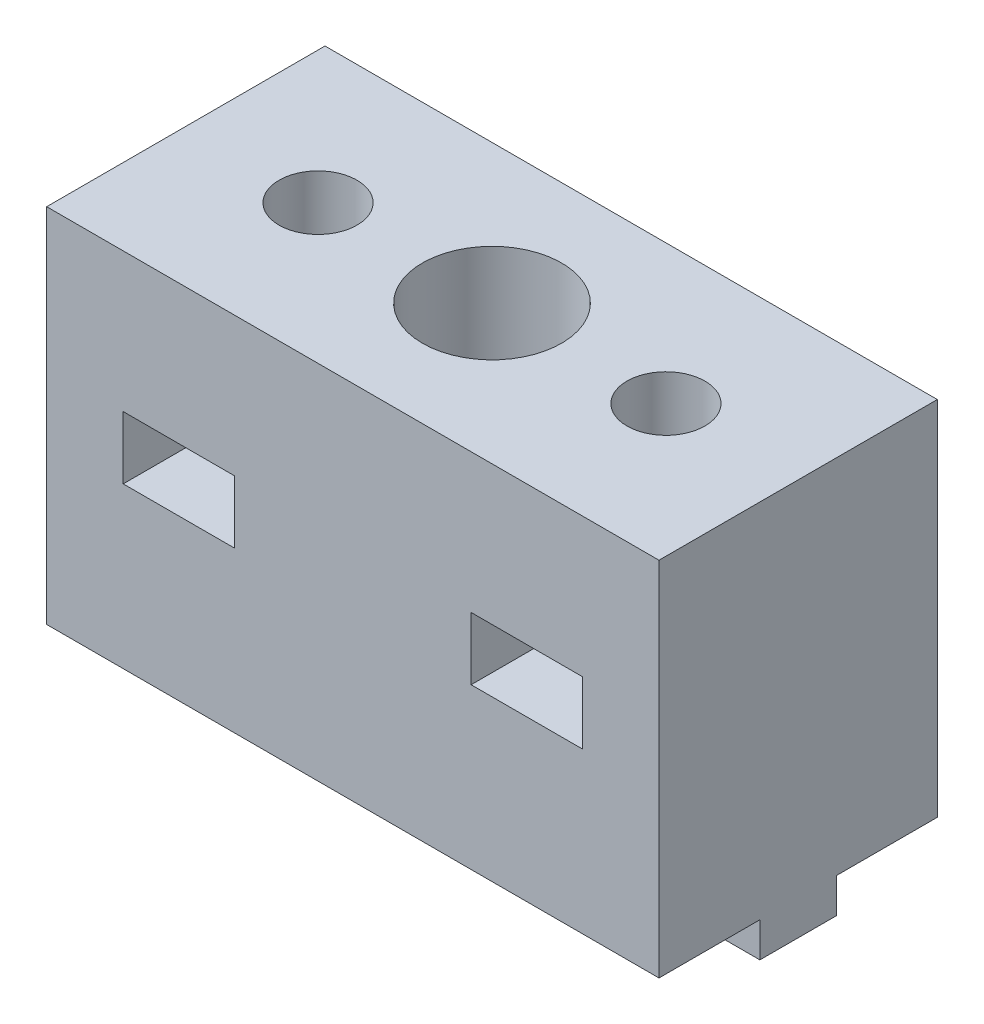
ISO-10303-21;
HEADER;
FILE_DESCRIPTION(('STEP AP214'),'2;1');
FILE_NAME('part.step','',(''),(''),'','','');
FILE_SCHEMA(('AUTOMOTIVE_DESIGN { 1 0 10303 214 1 1 1 1 }'));
ENDSEC;
DATA;
#1=APPLICATION_CONTEXT('core data for automotive mechanical design processes');
#2=APPLICATION_PROTOCOL_DEFINITION('international standard','automotive_design',2000,#1);
#3=PRODUCT_CONTEXT('',#1,'mechanical');
#4=PRODUCT('Part','Part','',(#3));
#5=PRODUCT_RELATED_PRODUCT_CATEGORY('part','',(#4));
#6=PRODUCT_DEFINITION_FORMATION('','',#4);
#7=PRODUCT_DEFINITION_CONTEXT('part definition',#1,'design');
#8=PRODUCT_DEFINITION('design','',#6,#7);
#9=PRODUCT_DEFINITION_SHAPE('','',#8);
#10=(LENGTH_UNIT() NAMED_UNIT(*) SI_UNIT(.MILLI.,.METRE.));
#11=(NAMED_UNIT(*) PLANE_ANGLE_UNIT() SI_UNIT($,.RADIAN.));
#12=(NAMED_UNIT(*) SI_UNIT($,.STERADIAN.) SOLID_ANGLE_UNIT());
#13=UNCERTAINTY_MEASURE_WITH_UNIT(LENGTH_MEASURE(1.E-05),#10,'distance_accuracy_value','');
#14=(GEOMETRIC_REPRESENTATION_CONTEXT(3) GLOBAL_UNCERTAINTY_ASSIGNED_CONTEXT((#13)) GLOBAL_UNIT_ASSIGNED_CONTEXT((#10,
#11,#12)) REPRESENTATION_CONTEXT('',''));
#15=CARTESIAN_POINT('',(0.,0.,0.));
#16=DIRECTION('',(0.,0.,1.));
#17=DIRECTION('',(1.,0.,0.));
#18=AXIS2_PLACEMENT_3D('',#15,#16,#17);
#19=CARTESIAN_POINT('',(21.3032417795605,-2.5,-10.));
#20=DIRECTION('',(0.,1.,0.));
#21=DIRECTION('',(0.,0.,1.));
#22=AXIS2_PLACEMENT_3D('',#19,#20,#21);
#23=CYLINDRICAL_SURFACE('',#22,2.8);
#24=CARTESIAN_POINT('',(21.3032417795605,5.,-10.));
#25=DIRECTION('',(0.,-1.,0.));
#26=DIRECTION('',(0.,0.,-1.));
#27=AXIS2_PLACEMENT_3D('',#24,#25,#26);
#28=CIRCLE('',#27,2.8);
#29=CARTESIAN_POINT('',(21.3032417795605,5.,-12.8));
#30=VERTEX_POINT('',#29);
#31=EDGE_CURVE('E309',#30,#30,#28,.F.);
#32=ORIENTED_EDGE('',*,*,#31,.T.);
#33=EDGE_LOOP('',(#32));
#34=FACE_BOUND('',#33,.T.);
#35=CARTESIAN_POINT('',(21.3032417795605,0.,-10.));
#36=DIRECTION('',(0.,-1.,0.));
#37=DIRECTION('',(0.,0.,-1.));
#38=AXIS2_PLACEMENT_3D('',#35,#36,#37);
#39=CIRCLE('',#38,2.8);
#40=CARTESIAN_POINT('',(21.3032417795605,0.,-12.8));
#41=VERTEX_POINT('',#40);
#42=EDGE_CURVE('E302',#41,#41,#39,.T.);
#43=ORIENTED_EDGE('',*,*,#42,.T.);
#44=EDGE_LOOP('',(#43));
#45=FACE_BOUND('',#44,.T.);
#46=ADVANCED_FACE('F35',(#34,#45),#23,.F.);
#47=CARTESIAN_POINT('',(8.80324177956045,-2.5,-10.));
#48=DIRECTION('',(0.,1.,0.));
#49=DIRECTION('',(0.,0.,1.));
#50=AXIS2_PLACEMENT_3D('',#47,#48,#49);
#51=CYLINDRICAL_SURFACE('',#50,2.8);
#52=CARTESIAN_POINT('',(8.80324177956045,16.,-10.));
#53=DIRECTION('',(0.,1.,0.));
#54=DIRECTION('',(0.,0.,1.));
#55=AXIS2_PLACEMENT_3D('',#52,#53,#54);
#56=CIRCLE('',#55,2.8);
#57=CARTESIAN_POINT('',(8.80324177956045,16.,-7.2));
#58=VERTEX_POINT('',#57);
#59=EDGE_CURVE('E39',#58,#58,#56,.F.);
#60=ORIENTED_EDGE('',*,*,#59,.T.);
#61=EDGE_LOOP('',(#60));
#62=FACE_BOUND('',#61,.T.);
#63=CARTESIAN_POINT('',(8.80324177956045,26.,-10.));
#64=DIRECTION('',(0.,1.,0.));
#65=DIRECTION('',(0.,0.,1.));
#66=AXIS2_PLACEMENT_3D('',#63,#64,#65);
#67=CIRCLE('',#66,2.8);
#68=CARTESIAN_POINT('',(8.80324177956045,26.,-7.2));
#69=VERTEX_POINT('',#68);
#70=EDGE_CURVE('E287',#69,#69,#67,.T.);
#71=ORIENTED_EDGE('',*,*,#70,.T.);
#72=EDGE_LOOP('',(#71));
#73=FACE_BOUND('',#72,.T.);
#74=ADVANCED_FACE('F494',(#62,#73),#51,.F.);
#75=CARTESIAN_POINT('',(33.8032417795605,-2.5,-10.));
#76=DIRECTION('',(0.,1.,0.));
#77=DIRECTION('',(0.,0.,1.));
#78=AXIS2_PLACEMENT_3D('',#75,#76,#77);
#79=CYLINDRICAL_SURFACE('',#78,2.8);
#80=CARTESIAN_POINT('',(33.8032417795605,16.,-10.));
#81=DIRECTION('',(0.,1.,0.));
#82=DIRECTION('',(0.,0.,1.));
#83=AXIS2_PLACEMENT_3D('',#80,#81,#82);
#84=CIRCLE('',#83,2.8);
#85=CARTESIAN_POINT('',(33.8032417795605,16.,-7.2));
#86=VERTEX_POINT('',#85);
#87=EDGE_CURVE('E318',#86,#86,#84,.F.);
#88=ORIENTED_EDGE('',*,*,#87,.T.);
#89=EDGE_LOOP('',(#88));
#90=FACE_BOUND('',#89,.T.);
#91=CARTESIAN_POINT('',(33.8032417795605,26.,-10.));
#92=DIRECTION('',(0.,1.,0.));
#93=DIRECTION('',(0.,0.,1.));
#94=AXIS2_PLACEMENT_3D('',#91,#92,#93);
#95=CIRCLE('',#94,2.8);
#96=CARTESIAN_POINT('',(33.8032417795605,26.,-7.2));
#97=VERTEX_POINT('',#96);
#98=EDGE_CURVE('E306',#97,#97,#95,.T.);
#99=ORIENTED_EDGE('',*,*,#98,.T.);
#100=EDGE_LOOP('',(#99));
#101=FACE_BOUND('',#100,.T.);
#102=ADVANCED_FACE('F521',(#90,#101),#79,.F.);
#103=CARTESIAN_POINT('',(43.3032417795605,-2.5,-12.75));
#104=DIRECTION('',(0.,0.,1.));
#105=DIRECTION('',(1.,0.,0.));
#106=AXIS2_PLACEMENT_3D('',#103,#104,#105);
#107=PLANE('',#106);
#108=DIRECTION('',(1.,0.,0.));
#109=VECTOR('',#108,1.);
#110=CARTESIAN_POINT('',(43.3032417795605,-2.5,-12.75));
#111=LINE('',#110,#109);
#112=CARTESIAN_POINT('',(34.3300244672031,-2.5,-12.75));
#113=VERTEX_POINT('',#112);
#114=CARTESIAN_POINT('',(43.3032417795605,-2.5,-12.75));
#115=VERTEX_POINT('',#114);
#116=EDGE_CURVE('E575',#113,#115,#111,.T.);
#117=ORIENTED_EDGE('',*,*,#116,.F.);
#118=DIRECTION('',(0.,1.,0.));
#119=VECTOR('',#118,1.);
#120=CARTESIAN_POINT('',(34.3300244672031,-2.5,-12.75));
#121=LINE('',#120,#119);
#122=CARTESIAN_POINT('',(34.3300244672031,0.,-12.75));
#123=VERTEX_POINT('',#122);
#124=EDGE_CURVE('E290',#113,#123,#121,.T.);
#125=ORIENTED_EDGE('',*,*,#124,.T.);
#126=DIRECTION('',(1.,0.,0.));
#127=VECTOR('',#126,1.);
#128=CARTESIAN_POINT('',(43.3032417795605,0.,-12.75));
#129=LINE('',#128,#127);
#130=CARTESIAN_POINT('',(43.3032417795605,0.,-12.75));
#131=VERTEX_POINT('',#130);
#132=EDGE_CURVE('E412',#123,#131,#129,.T.);
#133=ORIENTED_EDGE('',*,*,#132,.T.);
#134=DIRECTION('',(0.,1.,0.));
#135=VECTOR('',#134,1.);
#136=CARTESIAN_POINT('',(43.3032417795605,-2.5,-12.75));
#137=LINE('',#136,#135);
#138=EDGE_CURVE('E440',#115,#131,#137,.T.);
#139=ORIENTED_EDGE('',*,*,#138,.F.);
#140=EDGE_LOOP('',(#117,#125,#133,#139));
#141=FACE_BOUND('',#140,.T.);
#142=ADVANCED_FACE('F538',(#141),#107,.F.);
#143=CARTESIAN_POINT('',(26.3032417795604,-2.5,-12.75));
#144=VERTEX_POINT('',#143);
#145=CARTESIAN_POINT('',(33.2764590919178,-2.5,-12.75));
#146=VERTEX_POINT('',#145);
#147=EDGE_CURVE('E576',#144,#146,#111,.T.);
#148=ORIENTED_EDGE('',*,*,#147,.F.);
#149=DIRECTION('',(0.,-1.,0.));
#150=VECTOR('',#149,1.);
#151=CARTESIAN_POINT('',(26.3032417795604,11.4127122105133,-12.75));
#152=LINE('',#151,#150);
#153=CARTESIAN_POINT('',(26.3032417795604,0.,-12.75));
#154=VERTEX_POINT('',#153);
#155=EDGE_CURVE('E228',#154,#144,#152,.T.);
#156=ORIENTED_EDGE('',*,*,#155,.F.);
#157=CARTESIAN_POINT('',(33.2764590919178,0.,-12.75));
#158=VERTEX_POINT('',#157);
#159=EDGE_CURVE('E267',#154,#158,#129,.T.);
#160=ORIENTED_EDGE('',*,*,#159,.T.);
#161=DIRECTION('',(0.,1.,0.));
#162=VECTOR('',#161,1.);
#163=CARTESIAN_POINT('',(33.2764590919178,-2.5,-12.75));
#164=LINE('',#163,#162);
#165=EDGE_CURVE('E295',#158,#146,#164,.F.);
#166=ORIENTED_EDGE('',*,*,#165,.T.);
#167=EDGE_LOOP('',(#148,#156,#160,#166));
#168=FACE_BOUND('',#167,.T.);
#169=ADVANCED_FACE('F585',(#168),#107,.F.);
#170=CARTESIAN_POINT('',(0.,-2.5,0.));
#171=DIRECTION('',(0.,-1.,0.));
#172=DIRECTION('',(0.,0.,-1.));
#173=AXIS2_PLACEMENT_3D('',#170,#171,#172);
#174=PLANE('',#173);
#175=CARTESIAN_POINT('',(33.8032417795605,-2.5,-10.));
#176=DIRECTION('',(0.,1.,0.));
#177=DIRECTION('',(0.,0.,1.));
#178=AXIS2_PLACEMENT_3D('',#175,#176,#177);
#179=CIRCLE('',#178,2.8);
#180=CARTESIAN_POINT('',(34.3300244672031,-2.5,-7.25));
#181=VERTEX_POINT('',#180);
#182=EDGE_CURVE('E305',#181,#113,#179,.T.);
#183=ORIENTED_EDGE('',*,*,#182,.T.);
#184=ORIENTED_EDGE('',*,*,#116,.T.);
#185=DIRECTION('',(0.,0.,1.));
#186=VECTOR('',#185,1.);
#187=CARTESIAN_POINT('',(43.3032417795605,-2.5,-12.75));
#188=LINE('',#187,#186);
#189=CARTESIAN_POINT('',(43.3032417795605,-2.5,-7.25));
#190=VERTEX_POINT('',#189);
#191=EDGE_CURVE('E254',#115,#190,#188,.T.);
#192=ORIENTED_EDGE('',*,*,#191,.T.);
#193=DIRECTION('',(-1.,0.,0.));
#194=VECTOR('',#193,1.);
#195=CARTESIAN_POINT('',(43.3032417795605,-2.5,-7.25));
#196=LINE('',#195,#194);
#197=EDGE_CURVE('E246',#190,#181,#196,.T.);
#198=ORIENTED_EDGE('',*,*,#197,.T.);
#199=EDGE_LOOP('',(#183,#184,#192,#198));
#200=FACE_BOUND('',#199,.T.);
#201=ADVANCED_FACE('F533',(#200),#174,.T.);
#202=DIRECTION('',(0.,0.,1.));
#203=VECTOR('',#202,1.);
#204=CARTESIAN_POINT('',(26.3032417795604,-2.5,-7.25));
#205=LINE('',#204,#203);
#206=CARTESIAN_POINT('',(26.3032417795604,-2.5,-7.25));
#207=VERTEX_POINT('',#206);
#208=EDGE_CURVE('E222',#144,#207,#205,.T.);
#209=ORIENTED_EDGE('',*,*,#208,.F.);
#210=ORIENTED_EDGE('',*,*,#147,.T.);
#211=CARTESIAN_POINT('',(33.2764590919178,-2.5,-7.25));
#212=VERTEX_POINT('',#211);
#213=EDGE_CURVE('E245',#146,#212,#179,.T.);
#214=ORIENTED_EDGE('',*,*,#213,.T.);
#215=EDGE_CURVE('E237',#212,#207,#196,.T.);
#216=ORIENTED_EDGE('',*,*,#215,.T.);
#217=EDGE_LOOP('',(#209,#210,#214,#216));
#218=FACE_BOUND('',#217,.T.);
#219=ADVANCED_FACE('F243',(#218),#174,.T.);
#220=CARTESIAN_POINT('',(43.3032417795605,-2.5,-7.25));
#221=DIRECTION('',(0.,0.,-1.));
#222=DIRECTION('',(-1.,0.,0.));
#223=AXIS2_PLACEMENT_3D('',#220,#221,#222);
#224=PLANE('',#223);
#225=DIRECTION('',(-1.,0.,0.));
#226=VECTOR('',#225,1.);
#227=CARTESIAN_POINT('',(43.3032417795605,0.,-7.25));
#228=LINE('',#227,#226);
#229=CARTESIAN_POINT('',(33.2764590919178,0.,-7.25));
#230=VERTEX_POINT('',#229);
#231=CARTESIAN_POINT('',(26.3032417795604,0.,-7.25));
#232=VERTEX_POINT('',#231);
#233=EDGE_CURVE('E239',#230,#232,#228,.T.);
#234=ORIENTED_EDGE('',*,*,#233,.T.);
#235=DIRECTION('',(0.,-1.,0.));
#236=VECTOR('',#235,1.);
#237=CARTESIAN_POINT('',(26.3032417795604,11.4127122105133,-7.25));
#238=LINE('',#237,#236);
#239=EDGE_CURVE('E225',#232,#207,#238,.T.);
#240=ORIENTED_EDGE('',*,*,#239,.T.);
#241=ORIENTED_EDGE('',*,*,#215,.F.);
#242=DIRECTION('',(0.,1.,0.));
#243=VECTOR('',#242,1.);
#244=CARTESIAN_POINT('',(33.2764590919178,-2.5,-7.25));
#245=LINE('',#244,#243);
#246=EDGE_CURVE('E12',#212,#230,#245,.T.);
#247=ORIENTED_EDGE('',*,*,#246,.T.);
#248=EDGE_LOOP('',(#234,#240,#241,#247));
#249=FACE_BOUND('',#248,.T.);
#250=ADVANCED_FACE('F236',(#249),#224,.F.);
#251=CARTESIAN_POINT('',(16.3032417795605,-2.5,-7.25));
#252=VERTEX_POINT('',#251);
#253=CARTESIAN_POINT('',(9.33002446720312,-2.5,-7.25));
#254=VERTEX_POINT('',#253);
#255=EDGE_CURVE('E247',#252,#254,#196,.T.);
#256=ORIENTED_EDGE('',*,*,#255,.F.);
#257=DIRECTION('',(0.,-1.,0.));
#258=VECTOR('',#257,1.);
#259=CARTESIAN_POINT('',(16.3032417795605,11.4127122105133,-7.25));
#260=LINE('',#259,#258);
#261=CARTESIAN_POINT('',(16.3032417795605,0.,-7.25));
#262=VERTEX_POINT('',#261);
#263=EDGE_CURVE('E240',#262,#252,#260,.T.);
#264=ORIENTED_EDGE('',*,*,#263,.F.);
#265=CARTESIAN_POINT('',(9.33002446720312,0.,-7.25));
#266=VERTEX_POINT('',#265);
#267=EDGE_CURVE('E402',#262,#266,#228,.T.);
#268=ORIENTED_EDGE('',*,*,#267,.T.);
#269=DIRECTION('',(0.,1.,0.));
#270=VECTOR('',#269,1.);
#271=CARTESIAN_POINT('',(9.33002446720312,-2.5,-7.25));
#272=LINE('',#271,#270);
#273=EDGE_CURVE('E275',#266,#254,#272,.F.);
#274=ORIENTED_EDGE('',*,*,#273,.T.);
#275=EDGE_LOOP('',(#256,#264,#268,#274));
#276=FACE_BOUND('',#275,.T.);
#277=ADVANCED_FACE('F401',(#276),#224,.F.);
#278=CARTESIAN_POINT('',(8.27645909191779,-2.5,-7.25));
#279=VERTEX_POINT('',#278);
#280=CARTESIAN_POINT('',(-0.696758220439547,-2.5,-7.25000000000001));
#281=VERTEX_POINT('',#280);
#282=EDGE_CURVE('E249',#279,#281,#196,.T.);
#283=ORIENTED_EDGE('',*,*,#282,.F.);
#284=DIRECTION('',(0.,1.,0.));
#285=VECTOR('',#284,1.);
#286=CARTESIAN_POINT('',(8.27645909191779,-2.5,-7.25));
#287=LINE('',#286,#285);
#288=CARTESIAN_POINT('',(8.27645909191779,0.,-7.25));
#289=VERTEX_POINT('',#288);
#290=EDGE_CURVE('E269',#279,#289,#287,.T.);
#291=ORIENTED_EDGE('',*,*,#290,.T.);
#292=CARTESIAN_POINT('',(-0.696758220439547,0.,-7.25000000000001));
#293=VERTEX_POINT('',#292);
#294=EDGE_CURVE('E272',#289,#293,#228,.T.);
#295=ORIENTED_EDGE('',*,*,#294,.T.);
#296=DIRECTION('',(0.,1.,0.));
#297=VECTOR('',#296,1.);
#298=CARTESIAN_POINT('',(-0.696758220439547,-2.5,-7.25000000000001));
#299=LINE('',#298,#297);
#300=EDGE_CURVE('E439',#281,#293,#299,.T.);
#301=ORIENTED_EDGE('',*,*,#300,.F.);
#302=EDGE_LOOP('',(#283,#291,#295,#301));
#303=FACE_BOUND('',#302,.T.);
#304=ADVANCED_FACE('F541',(#303),#224,.F.);
#305=CARTESIAN_POINT('',(9.33002446720307,0.,-12.75));
#306=VERTEX_POINT('',#305);
#307=CARTESIAN_POINT('',(16.3032417795605,0.,-12.75));
#308=VERTEX_POINT('',#307);
#309=EDGE_CURVE('E265',#306,#308,#129,.T.);
#310=ORIENTED_EDGE('',*,*,#309,.T.);
#311=DIRECTION('',(0.,-1.,0.));
#312=VECTOR('',#311,1.);
#313=CARTESIAN_POINT('',(16.3032417795605,11.4127122105133,-12.75));
#314=LINE('',#313,#312);
#315=CARTESIAN_POINT('',(16.3032417795605,-2.5,-12.75));
#316=VERTEX_POINT('',#315);
#317=EDGE_CURVE('E383',#308,#316,#314,.T.);
#318=ORIENTED_EDGE('',*,*,#317,.T.);
#319=CARTESIAN_POINT('',(9.33002446720307,-2.5,-12.75));
#320=VERTEX_POINT('',#319);
#321=EDGE_CURVE('E577',#320,#316,#111,.T.);
#322=ORIENTED_EDGE('',*,*,#321,.F.);
#323=DIRECTION('',(0.,1.,0.));
#324=VECTOR('',#323,1.);
#325=CARTESIAN_POINT('',(9.33002446720307,-2.5,-12.75));
#326=LINE('',#325,#324);
#327=EDGE_CURVE('E278',#320,#306,#326,.T.);
#328=ORIENTED_EDGE('',*,*,#327,.T.);
#329=EDGE_LOOP('',(#310,#318,#322,#328));
#330=FACE_BOUND('',#329,.T.);
#331=ADVANCED_FACE('F422',(#330),#107,.F.);
#332=DIRECTION('',(0.,0.,-1.));
#333=VECTOR('',#332,1.);
#334=CARTESIAN_POINT('',(16.3032417795605,-2.5,-7.25));
#335=LINE('',#334,#333);
#336=EDGE_CURVE('E232',#252,#316,#335,.T.);
#337=ORIENTED_EDGE('',*,*,#336,.F.);
#338=ORIENTED_EDGE('',*,*,#255,.T.);
#339=CARTESIAN_POINT('',(8.80324177956045,-2.5,-10.));
#340=DIRECTION('',(0.,1.,0.));
#341=DIRECTION('',(0.,0.,1.));
#342=AXIS2_PLACEMENT_3D('',#339,#340,#341);
#343=CIRCLE('',#342,2.8);
#344=EDGE_CURVE('E286',#254,#320,#343,.T.);
#345=ORIENTED_EDGE('',*,*,#344,.T.);
#346=ORIENTED_EDGE('',*,*,#321,.T.);
#347=EDGE_LOOP('',(#337,#338,#345,#346));
#348=FACE_BOUND('',#347,.T.);
#349=ADVANCED_FACE('F534',(#348),#174,.T.);
#350=CARTESIAN_POINT('',(-0.696758220439547,26.,0.));
#351=DIRECTION('',(1.,0.,0.));
#352=DIRECTION('',(0.,0.,-1.));
#353=AXIS2_PLACEMENT_3D('',#350,#351,#352);
#354=PLANE('',#353);
#355=DIRECTION('',(0.,0.,1.));
#356=VECTOR('',#355,1.);
#357=CARTESIAN_POINT('',(-0.696758220439547,0.,0.));
#358=LINE('',#357,#356);
#359=CARTESIAN_POINT('',(-0.696758220439547,0.,-20.));
#360=VERTEX_POINT('',#359);
#361=CARTESIAN_POINT('',(-0.696758220439547,0.,-12.75));
#362=VERTEX_POINT('',#361);
#363=EDGE_CURVE('E460',#360,#362,#358,.T.);
#364=ORIENTED_EDGE('',*,*,#363,.T.);
#365=DIRECTION('',(0.,1.,0.));
#366=VECTOR('',#365,1.);
#367=CARTESIAN_POINT('',(-0.696758220439547,-2.5,-12.75));
#368=LINE('',#367,#366);
#369=CARTESIAN_POINT('',(-0.696758220439547,-2.5,-12.75));
#370=VERTEX_POINT('',#369);
#371=EDGE_CURVE('E435',#370,#362,#368,.T.);
#372=ORIENTED_EDGE('',*,*,#371,.F.);
#373=DIRECTION('',(0.,0.,-1.));
#374=VECTOR('',#373,1.);
#375=CARTESIAN_POINT('',(-0.696758220439547,-2.5,-12.75));
#376=LINE('',#375,#374);
#377=EDGE_CURVE('E251',#281,#370,#376,.T.);
#378=ORIENTED_EDGE('',*,*,#377,.F.);
#379=ORIENTED_EDGE('',*,*,#300,.T.);
#380=CARTESIAN_POINT('',(-0.696758220439547,0.,0.));
#381=VERTEX_POINT('',#380);
#382=EDGE_CURVE('E448',#293,#381,#358,.T.);
#383=ORIENTED_EDGE('',*,*,#382,.T.);
#384=DIRECTION('',(0.,-1.,0.));
#385=VECTOR('',#384,1.);
#386=CARTESIAN_POINT('',(-0.696758220439547,26.,0.));
#387=LINE('',#386,#385);
#388=CARTESIAN_POINT('',(-0.696758220439547,26.,0.));
#389=VERTEX_POINT('',#388);
#390=EDGE_CURVE('E477',#389,#381,#387,.T.);
#391=ORIENTED_EDGE('',*,*,#390,.F.);
#392=DIRECTION('',(0.,0.,1.));
#393=VECTOR('',#392,1.);
#394=CARTESIAN_POINT('',(-0.696758220439547,26.,0.));
#395=LINE('',#394,#393);
#396=CARTESIAN_POINT('',(-0.696758220439547,26.,-20.));
#397=VERTEX_POINT('',#396);
#398=EDGE_CURVE('E449',#397,#389,#395,.T.);
#399=ORIENTED_EDGE('',*,*,#398,.F.);
#400=DIRECTION('',(0.,-1.,0.));
#401=VECTOR('',#400,1.);
#402=CARTESIAN_POINT('',(-0.696758220439547,26.,-20.));
#403=LINE('',#402,#401);
#404=EDGE_CURVE('E459',#397,#360,#403,.T.);
#405=ORIENTED_EDGE('',*,*,#404,.T.);
#406=EDGE_LOOP('',(#364,#372,#378,#379,#383,#391,#399,#405));
#407=FACE_BOUND('',#406,.T.);
#408=ADVANCED_FACE('F37',(#407),#354,.F.);
#409=CARTESIAN_POINT('',(-0.696758220439547,26.,0.));
#410=DIRECTION('',(0.,0.,-1.));
#411=DIRECTION('',(-1.,0.,0.));
#412=AXIS2_PLACEMENT_3D('',#409,#410,#411);
#413=PLANE('',#412);
#414=DIRECTION('',(1.,0.,0.));
#415=VECTOR('',#414,1.);
#416=CARTESIAN_POINT('',(12.8032417795605,16.,0.));
#417=LINE('',#416,#415);
#418=CARTESIAN_POINT('',(4.80324177956045,16.,0.));
#419=VERTEX_POINT('',#418);
#420=CARTESIAN_POINT('',(12.8032417795605,16.,0.));
#421=VERTEX_POINT('',#420);
#422=EDGE_CURVE('E355',#419,#421,#417,.T.);
#423=ORIENTED_EDGE('',*,*,#422,.T.);
#424=DIRECTION('',(0.,-1.,0.));
#425=VECTOR('',#424,1.);
#426=CARTESIAN_POINT('',(12.8032417795605,11.5,0.));
#427=LINE('',#426,#425);
#428=CARTESIAN_POINT('',(12.8032417795605,11.5,0.));
#429=VERTEX_POINT('',#428);
#430=EDGE_CURVE('E365',#421,#429,#427,.T.);
#431=ORIENTED_EDGE('',*,*,#430,.T.);
#432=DIRECTION('',(-1.,0.,0.));
#433=VECTOR('',#432,1.);
#434=CARTESIAN_POINT('',(12.8032417795605,11.5,0.));
#435=LINE('',#434,#433);
#436=CARTESIAN_POINT('',(4.80324177956045,11.5,0.));
#437=VERTEX_POINT('',#436);
#438=EDGE_CURVE('E377',#429,#437,#435,.T.);
#439=ORIENTED_EDGE('',*,*,#438,.T.);
#440=DIRECTION('',(0.,1.,0.));
#441=VECTOR('',#440,1.);
#442=CARTESIAN_POINT('',(4.80324177956045,11.5,0.));
#443=LINE('',#442,#441);
#444=EDGE_CURVE('E52',#437,#419,#443,.T.);
#445=ORIENTED_EDGE('',*,*,#444,.T.);
#446=EDGE_LOOP('',(#423,#431,#439,#445));
#447=FACE_BOUND('',#446,.T.);
#448=DIRECTION('',(1.,0.,0.));
#449=VECTOR('',#448,1.);
#450=CARTESIAN_POINT('',(37.8032417795605,16.,0.));
#451=LINE('',#450,#449);
#452=CARTESIAN_POINT('',(29.8032417795605,16.,0.));
#453=VERTEX_POINT('',#452);
#454=CARTESIAN_POINT('',(37.8032417795605,16.,0.));
#455=VERTEX_POINT('',#454);
#456=EDGE_CURVE('E323',#453,#455,#451,.T.);
#457=ORIENTED_EDGE('',*,*,#456,.T.);
#458=DIRECTION('',(0.,-1.,0.));
#459=VECTOR('',#458,1.);
#460=CARTESIAN_POINT('',(37.8032417795605,11.5,0.));
#461=LINE('',#460,#459);
#462=CARTESIAN_POINT('',(37.8032417795605,11.5,0.));
#463=VERTEX_POINT('',#462);
#464=EDGE_CURVE('E333',#455,#463,#461,.T.);
#465=ORIENTED_EDGE('',*,*,#464,.T.);
#466=DIRECTION('',(-1.,0.,0.));
#467=VECTOR('',#466,1.);
#468=CARTESIAN_POINT('',(37.8032417795605,11.5,0.));
#469=LINE('',#468,#467);
#470=CARTESIAN_POINT('',(29.8032417795605,11.5,0.));
#471=VERTEX_POINT('',#470);
#472=EDGE_CURVE('E347',#463,#471,#469,.T.);
#473=ORIENTED_EDGE('',*,*,#472,.T.);
#474=DIRECTION('',(0.,1.,0.));
#475=VECTOR('',#474,1.);
#476=CARTESIAN_POINT('',(29.8032417795605,11.5,0.));
#477=LINE('',#476,#475);
#478=EDGE_CURVE('E344',#471,#453,#477,.T.);
#479=ORIENTED_EDGE('',*,*,#478,.T.);
#480=EDGE_LOOP('',(#457,#465,#473,#479));
#481=FACE_BOUND('',#480,.T.);
#482=DIRECTION('',(1.,0.,0.));
#483=VECTOR('',#482,1.);
#484=CARTESIAN_POINT('',(-0.696758220439547,0.,0.));
#485=LINE('',#484,#483);
#486=CARTESIAN_POINT('',(43.3032417795605,0.,0.));
#487=VERTEX_POINT('',#486);
#488=EDGE_CURVE('E462',#381,#487,#485,.T.);
#489=ORIENTED_EDGE('',*,*,#488,.T.);
#490=DIRECTION('',(0.,-1.,0.));
#491=VECTOR('',#490,1.);
#492=CARTESIAN_POINT('',(43.3032417795605,26.,0.));
#493=LINE('',#492,#491);
#494=CARTESIAN_POINT('',(43.3032417795605,26.,0.));
#495=VERTEX_POINT('',#494);
#496=EDGE_CURVE('E474',#495,#487,#493,.T.);
#497=ORIENTED_EDGE('',*,*,#496,.F.);
#498=DIRECTION('',(1.,0.,0.));
#499=VECTOR('',#498,1.);
#500=CARTESIAN_POINT('',(-0.696758220439547,26.,0.));
#501=LINE('',#500,#499);
#502=EDGE_CURVE('E452',#389,#495,#501,.T.);
#503=ORIENTED_EDGE('',*,*,#502,.F.);
#504=ORIENTED_EDGE('',*,*,#390,.T.);
#505=EDGE_LOOP('',(#489,#497,#503,#504));
#506=FACE_BOUND('',#505,.T.);
#507=ADVANCED_FACE('F554',(#447,#481,#506),#413,.F.);
#508=CARTESIAN_POINT('',(43.3032417795605,26.,0.));
#509=DIRECTION('',(-1.,0.,0.));
#510=DIRECTION('',(0.,0.,1.));
#511=AXIS2_PLACEMENT_3D('',#508,#509,#510);
#512=PLANE('',#511);
#513=DIRECTION('',(0.,0.,-1.));
#514=VECTOR('',#513,1.);
#515=CARTESIAN_POINT('',(43.3032417795605,0.,0.));
#516=LINE('',#515,#514);
#517=CARTESIAN_POINT('',(43.3032417795605,0.,-7.25));
#518=VERTEX_POINT('',#517);
#519=EDGE_CURVE('E465',#487,#518,#516,.T.);
#520=ORIENTED_EDGE('',*,*,#519,.T.);
#521=DIRECTION('',(0.,1.,0.));
#522=VECTOR('',#521,1.);
#523=CARTESIAN_POINT('',(43.3032417795605,-2.5,-7.25));
#524=LINE('',#523,#522);
#525=EDGE_CURVE('E443',#190,#518,#524,.T.);
#526=ORIENTED_EDGE('',*,*,#525,.F.);
#527=ORIENTED_EDGE('',*,*,#191,.F.);
#528=ORIENTED_EDGE('',*,*,#138,.T.);
#529=CARTESIAN_POINT('',(43.3032417795605,0.,-20.));
#530=VERTEX_POINT('',#529);
#531=EDGE_CURVE('E464',#131,#530,#516,.T.);
#532=ORIENTED_EDGE('',*,*,#531,.T.);
#533=DIRECTION('',(0.,-1.,0.));
#534=VECTOR('',#533,1.);
#535=CARTESIAN_POINT('',(43.3032417795605,26.,-20.));
#536=LINE('',#535,#534);
#537=CARTESIAN_POINT('',(43.3032417795605,26.,-20.));
#538=VERTEX_POINT('',#537);
#539=EDGE_CURVE('E471',#538,#530,#536,.T.);
#540=ORIENTED_EDGE('',*,*,#539,.F.);
#541=DIRECTION('',(0.,0.,-1.));
#542=VECTOR('',#541,1.);
#543=CARTESIAN_POINT('',(43.3032417795605,26.,0.));
#544=LINE('',#543,#542);
#545=EDGE_CURVE('E455',#495,#538,#544,.T.);
#546=ORIENTED_EDGE('',*,*,#545,.F.);
#547=ORIENTED_EDGE('',*,*,#496,.T.);
#548=EDGE_LOOP('',(#520,#526,#527,#528,#532,#540,#546,#547));
#549=FACE_BOUND('',#548,.T.);
#550=ADVANCED_FACE('F551',(#549),#512,.F.);
#551=CARTESIAN_POINT('',(-0.696758220439547,26.,-20.));
#552=DIRECTION('',(0.,0.,1.));
#553=DIRECTION('',(1.,0.,0.));
#554=AXIS2_PLACEMENT_3D('',#551,#552,#553);
#555=PLANE('',#554);
#556=DIRECTION('',(-1.,0.,0.));
#557=VECTOR('',#556,1.);
#558=CARTESIAN_POINT('',(12.8032417795605,11.5,-20.));
#559=LINE('',#558,#557);
#560=CARTESIAN_POINT('',(12.8032417795605,11.5,-20.));
#561=VERTEX_POINT('',#560);
#562=CARTESIAN_POINT('',(4.80324177956045,11.5,-20.));
#563=VERTEX_POINT('',#562);
#564=EDGE_CURVE('E369',#561,#563,#559,.T.);
#565=ORIENTED_EDGE('',*,*,#564,.F.);
#566=DIRECTION('',(0.,-1.,0.));
#567=VECTOR('',#566,1.);
#568=CARTESIAN_POINT('',(12.8032417795605,11.5,-20.));
#569=LINE('',#568,#567);
#570=CARTESIAN_POINT('',(12.8032417795605,16.,-20.));
#571=VERTEX_POINT('',#570);
#572=EDGE_CURVE('E60',#571,#561,#569,.T.);
#573=ORIENTED_EDGE('',*,*,#572,.F.);
#574=DIRECTION('',(1.,0.,0.));
#575=VECTOR('',#574,1.);
#576=CARTESIAN_POINT('',(12.8032417795605,16.,-20.));
#577=LINE('',#576,#575);
#578=CARTESIAN_POINT('',(4.80324177956045,16.,-20.));
#579=VERTEX_POINT('',#578);
#580=EDGE_CURVE('E362',#579,#571,#577,.T.);
#581=ORIENTED_EDGE('',*,*,#580,.F.);
#582=DIRECTION('',(0.,1.,0.));
#583=VECTOR('',#582,1.);
#584=CARTESIAN_POINT('',(4.80324177956045,11.5,-20.));
#585=LINE('',#584,#583);
#586=EDGE_CURVE('E366',#563,#579,#585,.T.);
#587=ORIENTED_EDGE('',*,*,#586,.F.);
#588=EDGE_LOOP('',(#565,#573,#581,#587));
#589=FACE_BOUND('',#588,.T.);
#590=DIRECTION('',(-1.,0.,0.));
#591=VECTOR('',#590,1.);
#592=CARTESIAN_POINT('',(37.8032417795605,11.5,-20.));
#593=LINE('',#592,#591);
#594=CARTESIAN_POINT('',(37.8032417795605,11.5,-20.));
#595=VERTEX_POINT('',#594);
#596=CARTESIAN_POINT('',(29.8032417795605,11.5,-20.));
#597=VERTEX_POINT('',#596);
#598=EDGE_CURVE('E337',#595,#597,#593,.T.);
#599=ORIENTED_EDGE('',*,*,#598,.F.);
#600=DIRECTION('',(0.,-1.,0.));
#601=VECTOR('',#600,1.);
#602=CARTESIAN_POINT('',(37.8032417795605,11.5,-20.));
#603=LINE('',#602,#601);
#604=CARTESIAN_POINT('',(37.8032417795605,16.,-20.));
#605=VERTEX_POINT('',#604);
#606=EDGE_CURVE('E340',#605,#595,#603,.T.);
#607=ORIENTED_EDGE('',*,*,#606,.F.);
#608=DIRECTION('',(1.,0.,0.));
#609=VECTOR('',#608,1.);
#610=CARTESIAN_POINT('',(37.8032417795605,16.,-20.));
#611=LINE('',#610,#609);
#612=CARTESIAN_POINT('',(29.8032417795605,16.,-20.));
#613=VERTEX_POINT('',#612);
#614=EDGE_CURVE('E330',#613,#605,#611,.T.);
#615=ORIENTED_EDGE('',*,*,#614,.F.);
#616=DIRECTION('',(0.,1.,0.));
#617=VECTOR('',#616,1.);
#618=CARTESIAN_POINT('',(29.8032417795605,11.5,-20.));
#619=LINE('',#618,#617);
#620=EDGE_CURVE('E334',#597,#613,#619,.T.);
#621=ORIENTED_EDGE('',*,*,#620,.F.);
#622=EDGE_LOOP('',(#599,#607,#615,#621));
#623=FACE_BOUND('',#622,.T.);
#624=DIRECTION('',(-1.,0.,0.));
#625=VECTOR('',#624,1.);
#626=CARTESIAN_POINT('',(-0.696758220439547,0.,-20.));
#627=LINE('',#626,#625);
#628=EDGE_CURVE('E453',#530,#360,#627,.T.);
#629=ORIENTED_EDGE('',*,*,#628,.T.);
#630=ORIENTED_EDGE('',*,*,#404,.F.);
#631=DIRECTION('',(-1.,0.,0.));
#632=VECTOR('',#631,1.);
#633=CARTESIAN_POINT('',(-0.696758220439547,26.,-20.));
#634=LINE('',#633,#632);
#635=EDGE_CURVE('E457',#538,#397,#634,.T.);
#636=ORIENTED_EDGE('',*,*,#635,.F.);
#637=ORIENTED_EDGE('',*,*,#539,.T.);
#638=EDGE_LOOP('',(#629,#630,#636,#637));
#639=FACE_BOUND('',#638,.T.);
#640=ADVANCED_FACE('F545',(#589,#623,#639),#555,.F.);
#641=CARTESIAN_POINT('',(0.,26.,0.));
#642=DIRECTION('',(0.,-1.,0.));
#643=DIRECTION('',(0.,0.,-1.));
#644=AXIS2_PLACEMENT_3D('',#641,#642,#643);
#645=PLANE('',#644);
#646=CARTESIAN_POINT('',(21.3032417795605,26.,-10.));
#647=DIRECTION('',(0.,1.,0.));
#648=DIRECTION('',(0.,0.,1.));
#649=AXIS2_PLACEMENT_3D('',#646,#647,#648);
#650=CIRCLE('',#649,5.);
#651=CARTESIAN_POINT('',(21.3032417795605,26.,-5.));
#652=VERTEX_POINT('',#651);
#653=EDGE_CURVE('E315',#652,#652,#650,.T.);
#654=ORIENTED_EDGE('',*,*,#653,.F.);
#655=EDGE_LOOP('',(#654));
#656=FACE_BOUND('',#655,.T.);
#657=ORIENTED_EDGE('',*,*,#98,.F.);
#658=EDGE_LOOP('',(#657));
#659=FACE_BOUND('',#658,.T.);
#660=ORIENTED_EDGE('',*,*,#70,.F.);
#661=EDGE_LOOP('',(#660));
#662=FACE_BOUND('',#661,.T.);
#663=ORIENTED_EDGE('',*,*,#398,.T.);
#664=ORIENTED_EDGE('',*,*,#502,.T.);
#665=ORIENTED_EDGE('',*,*,#545,.T.);
#666=ORIENTED_EDGE('',*,*,#635,.T.);
#667=EDGE_LOOP('',(#663,#664,#665,#666));
#668=FACE_BOUND('',#667,.T.);
#669=ADVANCED_FACE('F542',(#656,#659,#662,#668),#645,.F.);
#670=CARTESIAN_POINT('',(0.,0.,0.));
#671=DIRECTION('',(0.,-1.,0.));
#672=DIRECTION('',(0.,0.,-1.));
#673=AXIS2_PLACEMENT_3D('',#670,#671,#672);
#674=PLANE('',#673);
#675=DIRECTION('',(0.,0.,1.));
#676=VECTOR('',#675,1.);
#677=CARTESIAN_POINT('',(16.3032417795605,0.,-7.25));
#678=LINE('',#677,#676);
#679=EDGE_CURVE('E387',#308,#262,#678,.T.);
#680=ORIENTED_EDGE('',*,*,#679,.F.);
#681=ORIENTED_EDGE('',*,*,#309,.F.);
#682=CARTESIAN_POINT('',(8.80324177956045,0.,-10.));
#683=DIRECTION('',(0.,-1.,0.));
#684=DIRECTION('',(0.,0.,-1.));
#685=AXIS2_PLACEMENT_3D('',#682,#683,#684);
#686=CIRCLE('',#685,2.8);
#687=CARTESIAN_POINT('',(8.27645909191783,0.,-12.75));
#688=VERTEX_POINT('',#687);
#689=EDGE_CURVE('E281',#688,#306,#686,.T.);
#690=ORIENTED_EDGE('',*,*,#689,.F.);
#691=EDGE_CURVE('E260',#362,#688,#129,.T.);
#692=ORIENTED_EDGE('',*,*,#691,.F.);
#693=ORIENTED_EDGE('',*,*,#363,.F.);
#694=ORIENTED_EDGE('',*,*,#628,.F.);
#695=ORIENTED_EDGE('',*,*,#531,.F.);
#696=ORIENTED_EDGE('',*,*,#132,.F.);
#697=CARTESIAN_POINT('',(33.8032417795605,0.,-10.));
#698=DIRECTION('',(0.,-1.,0.));
#699=DIRECTION('',(0.,0.,-1.));
#700=AXIS2_PLACEMENT_3D('',#697,#698,#699);
#701=CIRCLE('',#700,2.8);
#702=EDGE_CURVE('E298',#158,#123,#701,.T.);
#703=ORIENTED_EDGE('',*,*,#702,.F.);
#704=ORIENTED_EDGE('',*,*,#159,.F.);
#705=DIRECTION('',(0.,0.,-1.));
#706=VECTOR('',#705,1.);
#707=CARTESIAN_POINT('',(26.3032417795604,0.,-7.25));
#708=LINE('',#707,#706);
#709=EDGE_CURVE('E373',#232,#154,#708,.T.);
#710=ORIENTED_EDGE('',*,*,#709,.F.);
#711=ORIENTED_EDGE('',*,*,#233,.F.);
#712=CARTESIAN_POINT('',(33.8032417795605,0.,-10.));
#713=DIRECTION('',(0.,-1.,0.));
#714=DIRECTION('',(0.,0.,-1.));
#715=AXIS2_PLACEMENT_3D('',#712,#713,#714);
#716=CIRCLE('',#715,2.8);
#717=CARTESIAN_POINT('',(34.3300244672031,0.,-7.25));
#718=VERTEX_POINT('',#717);
#719=EDGE_CURVE('E300',#718,#230,#716,.T.);
#720=ORIENTED_EDGE('',*,*,#719,.F.);
#721=EDGE_CURVE('E409',#518,#718,#228,.T.);
#722=ORIENTED_EDGE('',*,*,#721,.F.);
#723=ORIENTED_EDGE('',*,*,#519,.F.);
#724=ORIENTED_EDGE('',*,*,#488,.F.);
#725=ORIENTED_EDGE('',*,*,#382,.F.);
#726=ORIENTED_EDGE('',*,*,#294,.F.);
#727=CARTESIAN_POINT('',(8.80324177956045,0.,-10.));
#728=DIRECTION('',(0.,-1.,0.));
#729=DIRECTION('',(0.,0.,-1.));
#730=AXIS2_PLACEMENT_3D('',#727,#728,#729);
#731=CIRCLE('',#730,2.8);
#732=EDGE_CURVE('E273',#266,#289,#731,.T.);
#733=ORIENTED_EDGE('',*,*,#732,.F.);
#734=ORIENTED_EDGE('',*,*,#267,.F.);
#735=EDGE_LOOP('',(#680,#681,#690,#692,#693,#694,#695,#696,#703,#704,#710,#711,#720,#722,#723,
#724,#725,#726,#733,#734));
#736=FACE_BOUND('',#735,.T.);
#737=ORIENTED_EDGE('',*,*,#42,.F.);
#738=EDGE_LOOP('',(#737));
#739=FACE_BOUND('',#738,.T.);
#740=ADVANCED_FACE('F405',(#736,#739),#674,.T.);
#741=ORIENTED_EDGE('',*,*,#721,.T.);
#742=DIRECTION('',(0.,1.,0.));
#743=VECTOR('',#742,1.);
#744=CARTESIAN_POINT('',(34.3300244672031,-2.5,-7.25));
#745=LINE('',#744,#743);
#746=EDGE_CURVE('E44',#718,#181,#745,.F.);
#747=ORIENTED_EDGE('',*,*,#746,.T.);
#748=ORIENTED_EDGE('',*,*,#197,.F.);
#749=ORIENTED_EDGE('',*,*,#525,.T.);
#750=EDGE_LOOP('',(#741,#747,#748,#749));
#751=FACE_BOUND('',#750,.T.);
#752=ADVANCED_FACE('F537',(#751),#224,.F.);
#753=ORIENTED_EDGE('',*,*,#691,.T.);
#754=DIRECTION('',(0.,1.,0.));
#755=VECTOR('',#754,1.);
#756=CARTESIAN_POINT('',(8.27645909191783,-2.5,-12.75));
#757=LINE('',#756,#755);
#758=CARTESIAN_POINT('',(8.27645909191784,-2.5,-12.75));
#759=VERTEX_POINT('',#758);
#760=EDGE_CURVE('E283',#688,#759,#757,.F.);
#761=ORIENTED_EDGE('',*,*,#760,.T.);
#762=EDGE_CURVE('E436',#370,#759,#111,.T.);
#763=ORIENTED_EDGE('',*,*,#762,.F.);
#764=ORIENTED_EDGE('',*,*,#371,.T.);
#765=EDGE_LOOP('',(#753,#761,#763,#764));
#766=FACE_BOUND('',#765,.T.);
#767=ADVANCED_FACE('F431',(#766),#107,.F.);
#768=CARTESIAN_POINT('',(8.80324177956045,-2.5,-10.));
#769=DIRECTION('',(0.,-1.,0.));
#770=DIRECTION('',(0.,0.,-1.));
#771=AXIS2_PLACEMENT_3D('',#768,#769,#770);
#772=CIRCLE('',#771,2.8);
#773=EDGE_CURVE('E480',#279,#759,#772,.T.);
#774=ORIENTED_EDGE('',*,*,#773,.F.);
#775=ORIENTED_EDGE('',*,*,#282,.T.);
#776=ORIENTED_EDGE('',*,*,#377,.T.);
#777=ORIENTED_EDGE('',*,*,#762,.T.);
#778=EDGE_LOOP('',(#774,#775,#776,#777));
#779=FACE_BOUND('',#778,.T.);
#780=ADVANCED_FACE('F530',(#779),#174,.T.);
#781=CARTESIAN_POINT('',(8.80324177956045,11.5,-10.));
#782=DIRECTION('',(0.,-1.,0.));
#783=DIRECTION('',(0.,0.,-1.));
#784=AXIS2_PLACEMENT_3D('',#781,#782,#783);
#785=CIRCLE('',#784,2.8);
#786=CARTESIAN_POINT('',(8.80324177956045,11.5,-12.8));
#787=VERTEX_POINT('',#786);
#788=EDGE_CURVE('E361',#787,#787,#785,.F.);
#789=ORIENTED_EDGE('',*,*,#788,.T.);
#790=EDGE_LOOP('',(#789));
#791=FACE_BOUND('',#790,.T.);
#792=ORIENTED_EDGE('',*,*,#773,.T.);
#793=ORIENTED_EDGE('',*,*,#760,.F.);
#794=ORIENTED_EDGE('',*,*,#689,.T.);
#795=ORIENTED_EDGE('',*,*,#327,.F.);
#796=ORIENTED_EDGE('',*,*,#344,.F.);
#797=ORIENTED_EDGE('',*,*,#273,.F.);
#798=ORIENTED_EDGE('',*,*,#732,.T.);
#799=ORIENTED_EDGE('',*,*,#290,.F.);
#800=EDGE_LOOP('',(#792,#793,#794,#795,#796,#797,#798,#799));
#801=FACE_BOUND('',#800,.T.);
#802=ADVANCED_FACE('F523',(#791,#801),#51,.F.);
#803=CARTESIAN_POINT('',(33.8032417795605,11.5,-10.));
#804=DIRECTION('',(0.,-1.,0.));
#805=DIRECTION('',(0.,0.,-1.));
#806=AXIS2_PLACEMENT_3D('',#803,#804,#805);
#807=CIRCLE('',#806,2.8);
#808=CARTESIAN_POINT('',(33.8032417795605,11.5,-12.8));
#809=VERTEX_POINT('',#808);
#810=EDGE_CURVE('E329',#809,#809,#807,.F.);
#811=ORIENTED_EDGE('',*,*,#810,.T.);
#812=EDGE_LOOP('',(#811));
#813=FACE_BOUND('',#812,.T.);
#814=ORIENTED_EDGE('',*,*,#182,.F.);
#815=ORIENTED_EDGE('',*,*,#746,.F.);
#816=ORIENTED_EDGE('',*,*,#719,.T.);
#817=ORIENTED_EDGE('',*,*,#246,.F.);
#818=ORIENTED_EDGE('',*,*,#213,.F.);
#819=ORIENTED_EDGE('',*,*,#165,.F.);
#820=ORIENTED_EDGE('',*,*,#702,.T.);
#821=ORIENTED_EDGE('',*,*,#124,.F.);
#822=EDGE_LOOP('',(#814,#815,#816,#817,#818,#819,#820,#821));
#823=FACE_BOUND('',#822,.T.);
#824=ADVANCED_FACE('F526',(#813,#823),#79,.F.);
#825=CARTESIAN_POINT('',(0.,5.,0.));
#826=DIRECTION('',(0.,-1.,0.));
#827=DIRECTION('',(0.,0.,-1.));
#828=AXIS2_PLACEMENT_3D('',#825,#826,#827);
#829=PLANE('',#828);
#830=CARTESIAN_POINT('',(21.3032417795605,5.,-10.));
#831=DIRECTION('',(0.,-1.,0.));
#832=DIRECTION('',(0.,0.,-1.));
#833=AXIS2_PLACEMENT_3D('',#830,#831,#832);
#834=CIRCLE('',#833,5.);
#835=CARTESIAN_POINT('',(21.3032417795605,5.,-15.));
#836=VERTEX_POINT('',#835);
#837=EDGE_CURVE('E312',#836,#836,#834,.F.);
#838=ORIENTED_EDGE('',*,*,#837,.T.);
#839=EDGE_LOOP('',(#838));
#840=FACE_BOUND('',#839,.T.);
#841=ORIENTED_EDGE('',*,*,#31,.F.);
#842=EDGE_LOOP('',(#841));
#843=FACE_BOUND('',#842,.T.);
#844=ADVANCED_FACE('F615',(#840,#843),#829,.F.);
#845=CARTESIAN_POINT('',(21.3032417795605,-14.142135623731,-10.));
#846=DIRECTION('',(0.,1.,0.));
#847=DIRECTION('',(0.,0.,1.));
#848=AXIS2_PLACEMENT_3D('',#845,#846,#847);
#849=CYLINDRICAL_SURFACE('',#848,5.);
#850=ORIENTED_EDGE('',*,*,#653,.T.);
#851=EDGE_LOOP('',(#850));
#852=FACE_BOUND('',#851,.T.);
#853=ORIENTED_EDGE('',*,*,#837,.F.);
#854=EDGE_LOOP('',(#853));
#855=FACE_BOUND('',#854,.T.);
#856=ADVANCED_FACE('F620',(#852,#855),#849,.F.);
#857=CARTESIAN_POINT('',(37.8032417795605,16.,0.));
#858=DIRECTION('',(0.,1.,0.));
#859=DIRECTION('',(0.,0.,1.));
#860=AXIS2_PLACEMENT_3D('',#857,#858,#859);
#861=PLANE('',#860);
#862=ORIENTED_EDGE('',*,*,#614,.T.);
#863=DIRECTION('',(0.,0.,-1.));
#864=VECTOR('',#863,1.);
#865=CARTESIAN_POINT('',(37.8032417795605,16.,0.));
#866=LINE('',#865,#864);
#867=EDGE_CURVE('E327',#455,#605,#866,.T.);
#868=ORIENTED_EDGE('',*,*,#867,.F.);
#869=ORIENTED_EDGE('',*,*,#456,.F.);
#870=DIRECTION('',(0.,0.,-1.));
#871=VECTOR('',#870,1.);
#872=CARTESIAN_POINT('',(29.8032417795605,16.,0.));
#873=LINE('',#872,#871);
#874=EDGE_CURVE('E325',#453,#613,#873,.T.);
#875=ORIENTED_EDGE('',*,*,#874,.T.);
#876=EDGE_LOOP('',(#862,#868,#869,#875));
#877=FACE_BOUND('',#876,.T.);
#878=ORIENTED_EDGE('',*,*,#87,.F.);
#879=EDGE_LOOP('',(#878));
#880=FACE_BOUND('',#879,.T.);
#881=ADVANCED_FACE('F626',(#877,#880),#861,.F.);
#882=CARTESIAN_POINT('',(37.8032417795605,11.5,0.));
#883=DIRECTION('',(0.,-1.,0.));
#884=DIRECTION('',(0.,0.,-1.));
#885=AXIS2_PLACEMENT_3D('',#882,#883,#884);
#886=PLANE('',#885);
#887=ORIENTED_EDGE('',*,*,#598,.T.);
#888=DIRECTION('',(0.,0.,-1.));
#889=VECTOR('',#888,1.);
#890=CARTESIAN_POINT('',(29.8032417795605,11.5,0.));
#891=LINE('',#890,#889);
#892=EDGE_CURVE('E322',#471,#597,#891,.T.);
#893=ORIENTED_EDGE('',*,*,#892,.F.);
#894=ORIENTED_EDGE('',*,*,#472,.F.);
#895=DIRECTION('',(0.,0.,-1.));
#896=VECTOR('',#895,1.);
#897=CARTESIAN_POINT('',(37.8032417795605,11.5,0.));
#898=LINE('',#897,#896);
#899=EDGE_CURVE('E319',#463,#595,#898,.T.);
#900=ORIENTED_EDGE('',*,*,#899,.T.);
#901=EDGE_LOOP('',(#887,#893,#894,#900));
#902=FACE_BOUND('',#901,.T.);
#903=ORIENTED_EDGE('',*,*,#810,.F.);
#904=EDGE_LOOP('',(#903));
#905=FACE_BOUND('',#904,.T.);
#906=ADVANCED_FACE('F624',(#902,#905),#886,.F.);
#907=CARTESIAN_POINT('',(37.8032417795605,11.5,0.));
#908=DIRECTION('',(1.,0.,0.));
#909=DIRECTION('',(0.,1.,0.));
#910=AXIS2_PLACEMENT_3D('',#907,#908,#909);
#911=PLANE('',#910);
#912=ORIENTED_EDGE('',*,*,#606,.T.);
#913=ORIENTED_EDGE('',*,*,#899,.F.);
#914=ORIENTED_EDGE('',*,*,#464,.F.);
#915=ORIENTED_EDGE('',*,*,#867,.T.);
#916=EDGE_LOOP('',(#912,#913,#914,#915));
#917=FACE_BOUND('',#916,.T.);
#918=ADVANCED_FACE('F510',(#917),#911,.F.);
#919=CARTESIAN_POINT('',(29.8032417795605,11.5,0.));
#920=DIRECTION('',(-1.,0.,0.));
#921=DIRECTION('',(0.,0.,1.));
#922=AXIS2_PLACEMENT_3D('',#919,#920,#921);
#923=PLANE('',#922);
#924=ORIENTED_EDGE('',*,*,#620,.T.);
#925=ORIENTED_EDGE('',*,*,#874,.F.);
#926=ORIENTED_EDGE('',*,*,#478,.F.);
#927=ORIENTED_EDGE('',*,*,#892,.T.);
#928=EDGE_LOOP('',(#924,#925,#926,#927));
#929=FACE_BOUND('',#928,.T.);
#930=ADVANCED_FACE('F500',(#929),#923,.F.);
#931=CARTESIAN_POINT('',(12.8032417795605,16.,0.));
#932=DIRECTION('',(0.,1.,0.));
#933=DIRECTION('',(0.,0.,1.));
#934=AXIS2_PLACEMENT_3D('',#931,#932,#933);
#935=PLANE('',#934);
#936=ORIENTED_EDGE('',*,*,#580,.T.);
#937=DIRECTION('',(0.,0.,-1.));
#938=VECTOR('',#937,1.);
#939=CARTESIAN_POINT('',(12.8032417795605,16.,0.));
#940=LINE('',#939,#938);
#941=EDGE_CURVE('E359',#421,#571,#940,.T.);
#942=ORIENTED_EDGE('',*,*,#941,.F.);
#943=ORIENTED_EDGE('',*,*,#422,.F.);
#944=DIRECTION('',(0.,0.,-1.));
#945=VECTOR('',#944,1.);
#946=CARTESIAN_POINT('',(4.80324177956045,16.,0.));
#947=LINE('',#946,#945);
#948=EDGE_CURVE('E357',#419,#579,#947,.T.);
#949=ORIENTED_EDGE('',*,*,#948,.T.);
#950=EDGE_LOOP('',(#936,#942,#943,#949));
#951=FACE_BOUND('',#950,.T.);
#952=ORIENTED_EDGE('',*,*,#59,.F.);
#953=EDGE_LOOP('',(#952));
#954=FACE_BOUND('',#953,.T.);
#955=ADVANCED_FACE('F497',(#951,#954),#935,.F.);
#956=CARTESIAN_POINT('',(12.8032417795605,11.5,0.));
#957=DIRECTION('',(0.,-1.,0.));
#958=DIRECTION('',(0.,0.,-1.));
#959=AXIS2_PLACEMENT_3D('',#956,#957,#958);
#960=PLANE('',#959);
#961=ORIENTED_EDGE('',*,*,#564,.T.);
#962=DIRECTION('',(0.,0.,-1.));
#963=VECTOR('',#962,1.);
#964=CARTESIAN_POINT('',(4.80324177956045,11.5,0.));
#965=LINE('',#964,#963);
#966=EDGE_CURVE('E354',#437,#563,#965,.T.);
#967=ORIENTED_EDGE('',*,*,#966,.F.);
#968=ORIENTED_EDGE('',*,*,#438,.F.);
#969=DIRECTION('',(0.,0.,-1.));
#970=VECTOR('',#969,1.);
#971=CARTESIAN_POINT('',(12.8032417795605,11.5,0.));
#972=LINE('',#971,#970);
#973=EDGE_CURVE('E352',#429,#561,#972,.T.);
#974=ORIENTED_EDGE('',*,*,#973,.T.);
#975=EDGE_LOOP('',(#961,#967,#968,#974));
#976=FACE_BOUND('',#975,.T.);
#977=ORIENTED_EDGE('',*,*,#788,.F.);
#978=EDGE_LOOP('',(#977));
#979=FACE_BOUND('',#978,.T.);
#980=ADVANCED_FACE('F499',(#976,#979),#960,.F.);
#981=CARTESIAN_POINT('',(12.8032417795605,11.5,0.));
#982=DIRECTION('',(1.,0.,0.));
#983=DIRECTION('',(0.,0.,-1.));
#984=AXIS2_PLACEMENT_3D('',#981,#982,#983);
#985=PLANE('',#984);
#986=ORIENTED_EDGE('',*,*,#572,.T.);
#987=ORIENTED_EDGE('',*,*,#973,.F.);
#988=ORIENTED_EDGE('',*,*,#430,.F.);
#989=ORIENTED_EDGE('',*,*,#941,.T.);
#990=EDGE_LOOP('',(#986,#987,#988,#989));
#991=FACE_BOUND('',#990,.T.);
#992=ADVANCED_FACE('F507',(#991),#985,.F.);
#993=CARTESIAN_POINT('',(4.80324177956045,11.5,0.));
#994=DIRECTION('',(-1.,0.,0.));
#995=DIRECTION('',(0.,0.,1.));
#996=AXIS2_PLACEMENT_3D('',#993,#994,#995);
#997=PLANE('',#996);
#998=ORIENTED_EDGE('',*,*,#586,.T.);
#999=ORIENTED_EDGE('',*,*,#948,.F.);
#1000=ORIENTED_EDGE('',*,*,#444,.F.);
#1001=ORIENTED_EDGE('',*,*,#966,.T.);
#1002=EDGE_LOOP('',(#998,#999,#1000,#1001));
#1003=FACE_BOUND('',#1002,.T.);
#1004=ADVANCED_FACE('F697',(#1003),#997,.F.);
#1005=CARTESIAN_POINT('',(26.3032417795604,11.4127122105133,-7.25));
#1006=DIRECTION('',(1.,0.,0.));
#1007=DIRECTION('',(0.,0.,-1.));
#1008=AXIS2_PLACEMENT_3D('',#1005,#1006,#1007);
#1009=PLANE('',#1008);
#1010=ORIENTED_EDGE('',*,*,#709,.T.);
#1011=ORIENTED_EDGE('',*,*,#155,.T.);
#1012=ORIENTED_EDGE('',*,*,#208,.T.);
#1013=ORIENTED_EDGE('',*,*,#239,.F.);
#1014=EDGE_LOOP('',(#1010,#1011,#1012,#1013));
#1015=FACE_BOUND('',#1014,.T.);
#1016=ADVANCED_FACE('F224',(#1015),#1009,.F.);
#1017=CARTESIAN_POINT('',(16.3032417795605,11.4127122105133,-7.25));
#1018=DIRECTION('',(-1.,0.,0.));
#1019=DIRECTION('',(0.,0.,1.));
#1020=AXIS2_PLACEMENT_3D('',#1017,#1018,#1019);
#1021=PLANE('',#1020);
#1022=ORIENTED_EDGE('',*,*,#679,.T.);
#1023=ORIENTED_EDGE('',*,*,#263,.T.);
#1024=ORIENTED_EDGE('',*,*,#336,.T.);
#1025=ORIENTED_EDGE('',*,*,#317,.F.);
#1026=EDGE_LOOP('',(#1022,#1023,#1024,#1025));
#1027=FACE_BOUND('',#1026,.T.);
#1028=ADVANCED_FACE('F393',(#1027),#1021,.F.);
#1029=CLOSED_SHELL('',(#46,#74,#102,#142,#169,#201,#219,#250,#277,#304,#331,#349,#408,#507,#550,
#640,#669,#740,#752,#767,#780,#802,#824,#844,#856,#881,#906,#918,#930,#955,#980,#992,#1004,
#1016,#1028));
#1030=MANIFOLD_SOLID_BREP('B2',#1029);
#1031=ADVANCED_BREP_SHAPE_REPRESENTATION('',(#18,#1030),#14);
#1032=SHAPE_DEFINITION_REPRESENTATION(#9,#1031);
ENDSEC;
END-ISO-10303-21;
